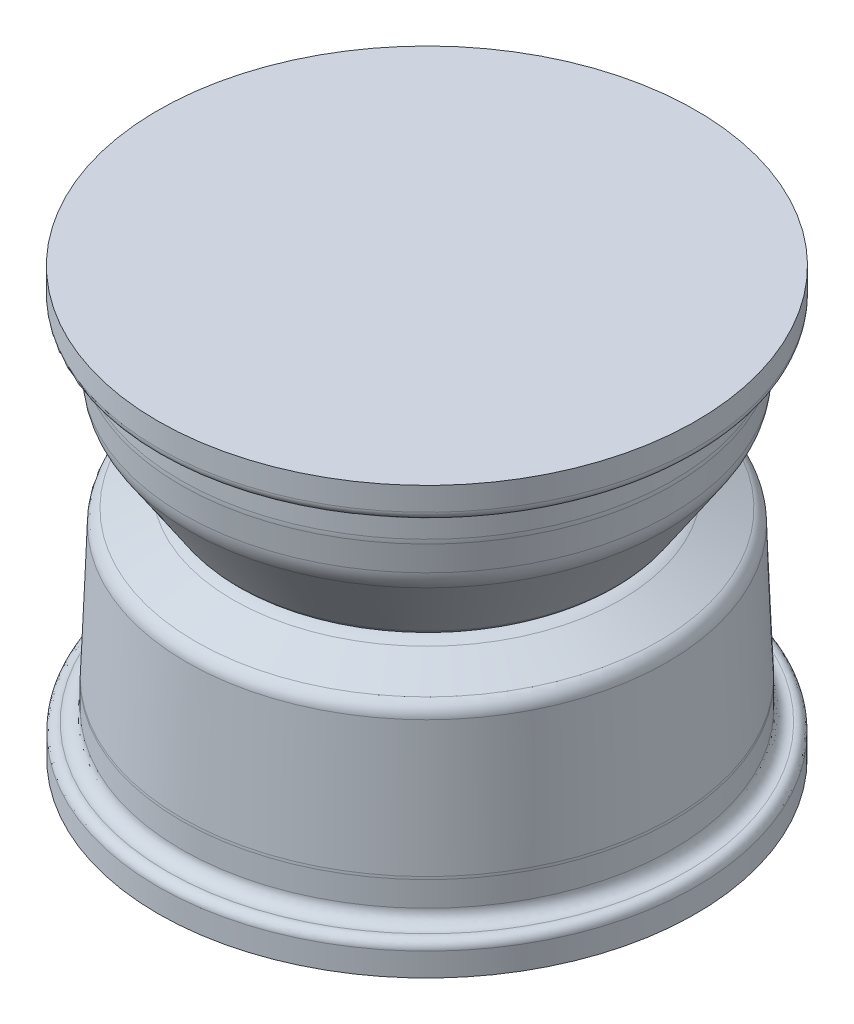
ISO-10303-21;
HEADER;
FILE_DESCRIPTION(('STEP AP214'),'2;1');
FILE_NAME('part.step','',(''),(''),'','','');
FILE_SCHEMA(('AUTOMOTIVE_DESIGN { 1 0 10303 214 1 1 1 1 }'));
ENDSEC;
DATA;
#1=APPLICATION_CONTEXT('core data for automotive mechanical design processes');
#2=APPLICATION_PROTOCOL_DEFINITION('international standard','automotive_design',2000,#1);
#3=PRODUCT_CONTEXT('',#1,'mechanical');
#4=PRODUCT('Part','Part','',(#3));
#5=PRODUCT_RELATED_PRODUCT_CATEGORY('part','',(#4));
#6=PRODUCT_DEFINITION_FORMATION('','',#4);
#7=PRODUCT_DEFINITION_CONTEXT('part definition',#1,'design');
#8=PRODUCT_DEFINITION('design','',#6,#7);
#9=PRODUCT_DEFINITION_SHAPE('','',#8);
#10=(LENGTH_UNIT() NAMED_UNIT(*) SI_UNIT(.MILLI.,.METRE.));
#11=(NAMED_UNIT(*) PLANE_ANGLE_UNIT() SI_UNIT($,.RADIAN.));
#12=(NAMED_UNIT(*) SI_UNIT($,.STERADIAN.) SOLID_ANGLE_UNIT());
#13=UNCERTAINTY_MEASURE_WITH_UNIT(LENGTH_MEASURE(1.E-05),#10,'distance_accuracy_value','');
#14=(GEOMETRIC_REPRESENTATION_CONTEXT(3) GLOBAL_UNCERTAINTY_ASSIGNED_CONTEXT((#13)) GLOBAL_UNIT_ASSIGNED_CONTEXT((#10,
#11,#12)) REPRESENTATION_CONTEXT('',''));
#15=CARTESIAN_POINT('',(0.,0.,0.));
#16=DIRECTION('',(0.,0.,1.));
#17=DIRECTION('',(1.,0.,0.));
#18=AXIS2_PLACEMENT_3D('',#15,#16,#17);
#19=CARTESIAN_POINT('',(0.,13.0472913738795,91.7987750000028));
#20=DIRECTION('',(0.,-1.,0.));
#21=DIRECTION('',(0.,0.,-1.));
#22=AXIS2_PLACEMENT_3D('',#19,#20,#21);
#23=PLANE('',#22);
#24=CARTESIAN_POINT('',(0.,13.0472913738795,0.));
#25=DIRECTION('',(0.,1.,0.));
#26=DIRECTION('',(0.,0.,1.));
#27=AXIS2_PLACEMENT_3D('',#24,#25,#26);
#28=CIRCLE('',#27,91.1860000000005);
#29=CARTESIAN_POINT('',(0.,13.0472913738795,91.1860000000005));
#30=VERTEX_POINT('',#29);
#31=EDGE_CURVE('E96',#30,#30,#28,.T.);
#32=ORIENTED_EDGE('',*,*,#31,.F.);
#33=EDGE_LOOP('',(#32));
#34=FACE_BOUND('',#33,.T.);
#35=CARTESIAN_POINT('',(0.,13.0472913738795,0.));
#36=DIRECTION('',(0.,1.,0.));
#37=DIRECTION('',(0.,0.,1.));
#38=AXIS2_PLACEMENT_3D('',#35,#36,#37);
#39=CIRCLE('',#38,91.7987750000028);
#40=CARTESIAN_POINT('',(0.,13.0472913738795,91.7987750000028));
#41=VERTEX_POINT('',#40);
#42=EDGE_CURVE('E10',#41,#41,#39,.T.);
#43=ORIENTED_EDGE('',*,*,#42,.T.);
#44=EDGE_LOOP('',(#43));
#45=FACE_BOUND('',#44,.T.);
#46=ADVANCED_FACE('F32',(#34,#45),#23,.F.);
#47=CARTESIAN_POINT('',(0.,13.0472913738795,91.7987750000028));
#48=CARTESIAN_POINT('',(0.,13.0472913738793,94.605850648923));
#49=CARTESIAN_POINT('',(0.,12.4331662406384,97.3224330848818));
#50=CARTESIAN_POINT('',(0.,11.2624547169263,99.8255002525088));
#51=(BOUNDED_CURVE() B_SPLINE_CURVE(3,(#47,#48,#49,#50),.UNSPECIFIED.,.F.,
.F.) B_SPLINE_CURVE_WITH_KNOTS((4,4),(0.,1.),
.UNSPECIFIED.) CURVE() GEOMETRIC_REPRESENTATION_ITEM() RATIONAL_B_SPLINE_CURVE((0.254333095030252,
0.254333095030252,0.258499793724843,0.266833191114025)) REPRESENTATION_ITEM(''));
#52=CARTESIAN_POINT('',(0.,55.,0.));
#53=DIRECTION('',(0.,1.,0.));
#54=AXIS1_PLACEMENT('',#52,#53);
#55=SURFACE_OF_REVOLUTION('',#51,#54);
#56=CARTESIAN_POINT('',(0.,11.2624547169263,0.));
#57=DIRECTION('',(0.,1.,0.));
#58=DIRECTION('',(0.,0.,1.));
#59=AXIS2_PLACEMENT_3D('',#56,#57,#58);
#60=CIRCLE('',#59,99.8255002525088);
#61=CARTESIAN_POINT('',(0.,11.2624547169263,99.8255002525088));
#62=VERTEX_POINT('',#61);
#63=EDGE_CURVE('E38',#62,#62,#60,.T.);
#64=ORIENTED_EDGE('',*,*,#63,.T.);
#65=EDGE_LOOP('',(#64));
#66=FACE_BOUND('',#65,.T.);
#67=ORIENTED_EDGE('',*,*,#42,.F.);
#68=EDGE_LOOP('',(#67));
#69=FACE_BOUND('',#68,.T.);
#70=ADVANCED_FACE('F110',(#66,#69),#55,.F.);
#71=CARTESIAN_POINT('',(0.,2.26769556187344,0.));
#72=DIRECTION('',(0.,-1.,0.));
#73=DIRECTION('',(0.,0.,-1.));
#74=AXIS2_PLACEMENT_3D('',#71,#72,#73);
#75=CONICAL_SURFACE('',#74,119.056955539065,1.13331210913777);
#76=ORIENTED_EDGE('',*,*,#63,.F.);
#77=EDGE_LOOP('',(#76));
#78=FACE_BOUND('',#77,.T.);
#79=CARTESIAN_POINT('',(0.,2.26769556187344,0.));
#80=DIRECTION('',(0.,1.,0.));
#81=DIRECTION('',(0.,0.,1.));
#82=AXIS2_PLACEMENT_3D('',#79,#80,#81);
#83=CIRCLE('',#82,119.056955539065);
#84=CARTESIAN_POINT('',(0.,2.26769556187344,119.056955539065));
#85=VERTEX_POINT('',#84);
#86=EDGE_CURVE('E42',#85,#85,#83,.T.);
#87=ORIENTED_EDGE('',*,*,#86,.T.);
#88=EDGE_LOOP('',(#87));
#89=FACE_BOUND('',#88,.T.);
#90=ADVANCED_FACE('F113',(#78,#89),#75,.T.);
#91=CARTESIAN_POINT('',(0.,-4.97886739746323,0.));
#92=DIRECTION('',(0.,1.,0.));
#93=DIRECTION('',(0.,0.,1.));
#94=AXIS2_PLACEMENT_3D('',#91,#92,#93);
#95=TOROIDAL_SURFACE('',#94,115.667659848753,8.);
#96=ORIENTED_EDGE('',*,*,#86,.F.);
#97=EDGE_LOOP('',(#96));
#98=FACE_BOUND('',#97,.T.);
#99=CARTESIAN_POINT('',(0.,-4.67176492476311,0.));
#100=DIRECTION('',(0.,1.,0.));
#101=DIRECTION('',(0.,0.,1.));
#102=AXIS2_PLACEMENT_3D('',#99,#100,#101);
#103=CIRCLE('',#102,123.661763180038);
#104=CARTESIAN_POINT('',(0.,-4.67176492476311,123.661763180038));
#105=VERTEX_POINT('',#104);
#106=EDGE_CURVE('E46',#105,#105,#103,.T.);
#107=ORIENTED_EDGE('',*,*,#106,.T.);
#108=EDGE_LOOP('',(#107));
#109=FACE_BOUND('',#108,.T.);
#110=ADVANCED_FACE('F116',(#98,#109),#95,.T.);
#111=CARTESIAN_POINT('',(0.,-72.7393119640824,0.));
#112=DIRECTION('',(0.,-1.,0.));
#113=DIRECTION('',(0.,0.,-1.));
#114=AXIS2_PLACEMENT_3D('',#111,#112,#113);
#115=CONICAL_SURFACE('',#114,126.276654574374,0.0383972435438753);
#116=ORIENTED_EDGE('',*,*,#106,.F.);
#117=EDGE_LOOP('',(#116));
#118=FACE_BOUND('',#117,.T.);
#119=CARTESIAN_POINT('',(0.,-72.7393119640824,0.));
#120=DIRECTION('',(0.,1.,0.));
#121=DIRECTION('',(0.,0.,1.));
#122=AXIS2_PLACEMENT_3D('',#119,#120,#121);
#123=CIRCLE('',#122,126.276654574374);
#124=CARTESIAN_POINT('',(0.,-72.7393119640824,126.276654574374));
#125=VERTEX_POINT('',#124);
#126=EDGE_CURVE('E51',#125,#125,#123,.T.);
#127=ORIENTED_EDGE('',*,*,#126,.T.);
#128=EDGE_LOOP('',(#127));
#129=FACE_BOUND('',#128,.T.);
#130=ADVANCED_FACE('F120',(#118,#129),#115,.T.);
#131=CARTESIAN_POINT('',(0.,-74.0828852821458,0.));
#132=DIRECTION('',(0.,1.,0.));
#133=DIRECTION('',(0.,0.,1.));
#134=AXIS2_PLACEMENT_3D('',#131,#132,#133);
#135=TOROIDAL_SURFACE('',#134,91.302452500002,35.);
#136=ORIENTED_EDGE('',*,*,#126,.F.);
#137=EDGE_LOOP('',(#136));
#138=FACE_BOUND('',#137,.T.);
#139=CARTESIAN_POINT('',(0.,-74.0828852821459,0.));
#140=DIRECTION('',(0.,1.,0.));
#141=DIRECTION('',(0.,0.,1.));
#142=AXIS2_PLACEMENT_3D('',#139,#140,#141);
#143=CIRCLE('',#142,126.302452500002);
#144=CARTESIAN_POINT('',(0.,-74.0828852821459,126.302452500002));
#145=VERTEX_POINT('',#144);
#146=EDGE_CURVE('E54',#145,#145,#143,.T.);
#147=ORIENTED_EDGE('',*,*,#146,.T.);
#148=EDGE_LOOP('',(#147));
#149=FACE_BOUND('',#148,.T.);
#150=ADVANCED_FACE('F124',(#138,#149),#135,.T.);
#151=CARTESIAN_POINT('',(0.,55.,0.));
#152=DIRECTION('',(0.,1.,0.));
#153=DIRECTION('',(0.,0.,1.));
#154=AXIS2_PLACEMENT_3D('',#151,#152,#153);
#155=CYLINDRICAL_SURFACE('',#154,126.302452500002);
#156=CARTESIAN_POINT('',(0.,-86.8372465785219,0.));
#157=DIRECTION('',(0.,1.,0.));
#158=DIRECTION('',(0.,0.,1.));
#159=AXIS2_PLACEMENT_3D('',#156,#157,#158);
#160=CIRCLE('',#159,126.302452500002);
#161=CARTESIAN_POINT('',(0.,-86.8372465785219,126.302452500002));
#162=VERTEX_POINT('',#161);
#163=EDGE_CURVE('E57',#162,#162,#160,.T.);
#164=ORIENTED_EDGE('',*,*,#163,.T.);
#165=EDGE_LOOP('',(#164));
#166=FACE_BOUND('',#165,.T.);
#167=ORIENTED_EDGE('',*,*,#146,.F.);
#168=EDGE_LOOP('',(#167));
#169=FACE_BOUND('',#168,.T.);
#170=ADVANCED_FACE('F128',(#166,#169),#155,.T.);
#171=CARTESIAN_POINT('',(0.,-93.1247086261212,133.519735500002));
#172=CARTESIAN_POINT('',(0.,-93.7891310907864,128.834697888006));
#173=CARTESIAN_POINT('',(0.,-90.3594848036121,126.302452500002));
#174=CARTESIAN_POINT('',(0.,-86.8372465785219,126.302452500002));
#175=(BOUNDED_CURVE() B_SPLINE_CURVE(3,(#171,#172,#173,#174),.UNSPECIFIED.,.F.,
.F.) B_SPLINE_CURVE_WITH_KNOTS((4,4),(0.,1.),
.UNSPECIFIED.) CURVE() GEOMETRIC_REPRESENTATION_ITEM() RATIONAL_B_SPLINE_CURVE((0.255591691964593,
0.242825015050018,0.327183181081988,0.508666190060503)) REPRESENTATION_ITEM(''));
#176=CARTESIAN_POINT('',(0.,55.,0.));
#177=DIRECTION('',(0.,1.,0.));
#178=AXIS1_PLACEMENT('',#176,#177);
#179=SURFACE_OF_REVOLUTION('',#175,#178);
#180=ORIENTED_EDGE('',*,*,#163,.F.);
#181=EDGE_LOOP('',(#180));
#182=FACE_BOUND('',#181,.T.);
#183=CARTESIAN_POINT('',(0.,-93.1247086261212,0.));
#184=DIRECTION('',(0.,1.,0.));
#185=DIRECTION('',(0.,0.,1.));
#186=AXIS2_PLACEMENT_3D('',#183,#184,#185);
#187=CIRCLE('',#186,133.519735500002);
#188=CARTESIAN_POINT('',(0.,-93.1247086261212,133.519735500002));
#189=VERTEX_POINT('',#188);
#190=EDGE_CURVE('E60',#189,#189,#187,.T.);
#191=ORIENTED_EDGE('',*,*,#190,.T.);
#192=EDGE_LOOP('',(#191));
#193=FACE_BOUND('',#192,.T.);
#194=ADVANCED_FACE('F132',(#182,#193),#179,.T.);
#195=CARTESIAN_POINT('',(0.,-93.1247086261212,133.519735500002));
#196=CARTESIAN_POINT('',(0.,-92.6729013501488,136.705561076159));
#197=CARTESIAN_POINT('',(0.,-95.0050608254273,138.427487940002));
#198=CARTESIAN_POINT('',(0.,-97.4001828184885,138.427487940002));
#199=(BOUNDED_CURVE() B_SPLINE_CURVE(3,(#195,#196,#197,#198),.UNSPECIFIED.,.F.,
.F.) B_SPLINE_CURVE_WITH_KNOTS((4,4),(0.,1.),
.UNSPECIFIED.) CURVE() GEOMETRIC_REPRESENTATION_ITEM() RATIONAL_B_SPLINE_CURVE((0.255591691964592,
0.242825015050017,0.327183181081988,0.508666190060503)) REPRESENTATION_ITEM(''));
#200=CARTESIAN_POINT('',(0.,55.,0.));
#201=DIRECTION('',(0.,1.,0.));
#202=AXIS1_PLACEMENT('',#200,#201);
#203=SURFACE_OF_REVOLUTION('',#199,#202);
#204=CARTESIAN_POINT('',(0.,-97.4001828184885,0.));
#205=DIRECTION('',(0.,1.,0.));
#206=DIRECTION('',(0.,0.,1.));
#207=AXIS2_PLACEMENT_3D('',#204,#205,#206);
#208=CIRCLE('',#207,138.427487940002);
#209=CARTESIAN_POINT('',(0.,-97.4001828184885,138.427487940002));
#210=VERTEX_POINT('',#209);
#211=EDGE_CURVE('E63',#210,#210,#208,.T.);
#212=ORIENTED_EDGE('',*,*,#211,.T.);
#213=EDGE_LOOP('',(#212));
#214=FACE_BOUND('',#213,.T.);
#215=ORIENTED_EDGE('',*,*,#190,.F.);
#216=EDGE_LOOP('',(#215));
#217=FACE_BOUND('',#216,.T.);
#218=ADVANCED_FACE('F136',(#214,#217),#203,.F.);
#219=CARTESIAN_POINT('',(0.,55.,0.));
#220=DIRECTION('',(0.,1.,0.));
#221=DIRECTION('',(0.,0.,1.));
#222=AXIS2_PLACEMENT_3D('',#219,#220,#221);
#223=CYLINDRICAL_SURFACE('',#222,138.427487940002);
#224=CARTESIAN_POINT('',(0.,-109.400182818489,0.));
#225=DIRECTION('',(0.,1.,0.));
#226=DIRECTION('',(0.,0.,1.));
#227=AXIS2_PLACEMENT_3D('',#224,#225,#226);
#228=CIRCLE('',#227,138.427487940002);
#229=CARTESIAN_POINT('',(0.,-109.400182818489,138.427487940002));
#230=VERTEX_POINT('',#229);
#231=EDGE_CURVE('E66',#230,#230,#228,.T.);
#232=ORIENTED_EDGE('',*,*,#231,.T.);
#233=EDGE_LOOP('',(#232));
#234=FACE_BOUND('',#233,.T.);
#235=ORIENTED_EDGE('',*,*,#211,.F.);
#236=EDGE_LOOP('',(#235));
#237=FACE_BOUND('',#236,.T.);
#238=ADVANCED_FACE('F140',(#234,#237),#223,.T.);
#239=CARTESIAN_POINT('',(0.,-109.400182818489,138.427487940002));
#240=DIRECTION('',(0.,-1.,0.));
#241=DIRECTION('',(0.,0.,-1.));
#242=AXIS2_PLACEMENT_3D('',#239,#240,#241);
#243=PLANE('',#242);
#244=ORIENTED_EDGE('',*,*,#231,.F.);
#245=EDGE_LOOP('',(#244));
#246=FACE_BOUND('',#245,.T.);
#247=ADVANCED_FACE('F150',(#246),#243,.T.);
#248=CARTESIAN_POINT('',(0.,110.365316058993,138.555289406168));
#249=DIRECTION('',(0.,-1.,0.));
#250=DIRECTION('',(0.,0.,-1.));
#251=AXIS2_PLACEMENT_3D('',#248,#249,#250);
#252=PLANE('',#251);
#253=CARTESIAN_POINT('',(0.,110.365316058993,0.));
#254=DIRECTION('',(0.,1.,0.));
#255=DIRECTION('',(0.,0.,1.));
#256=AXIS2_PLACEMENT_3D('',#253,#254,#255);
#257=CIRCLE('',#256,138.555289406168);
#258=CARTESIAN_POINT('',(0.,110.365316058993,138.555289406168));
#259=VERTEX_POINT('',#258);
#260=EDGE_CURVE('E69',#259,#259,#257,.T.);
#261=ORIENTED_EDGE('',*,*,#260,.T.);
#262=EDGE_LOOP('',(#261));
#263=FACE_BOUND('',#262,.T.);
#264=ADVANCED_FACE('F154',(#263),#252,.F.);
#265=CARTESIAN_POINT('',(0.,55.,0.));
#266=DIRECTION('',(0.,1.,0.));
#267=DIRECTION('',(0.,0.,1.));
#268=AXIS2_PLACEMENT_3D('',#265,#266,#267);
#269=CYLINDRICAL_SURFACE('',#268,138.555289406168);
#270=ORIENTED_EDGE('',*,*,#260,.F.);
#271=EDGE_LOOP('',(#270));
#272=FACE_BOUND('',#271,.T.);
#273=CARTESIAN_POINT('',(0.,98.3653160589928,0.));
#274=DIRECTION('',(0.,1.,0.));
#275=DIRECTION('',(0.,0.,1.));
#276=AXIS2_PLACEMENT_3D('',#273,#274,#275);
#277=CIRCLE('',#276,138.555289406168);
#278=CARTESIAN_POINT('',(0.,98.3653160589928,138.555289406168));
#279=VERTEX_POINT('',#278);
#280=EDGE_CURVE('E72',#279,#279,#277,.T.);
#281=ORIENTED_EDGE('',*,*,#280,.T.);
#282=EDGE_LOOP('',(#281));
#283=FACE_BOUND('',#282,.T.);
#284=ADVANCED_FACE('F158',(#272,#283),#269,.T.);
#285=CARTESIAN_POINT('',(0.,98.2420105318187,0.));
#286=DIRECTION('',(0.,1.,0.));
#287=DIRECTION('',(0.,0.,1.));
#288=AXIS2_PLACEMENT_3D('',#285,#286,#287);
#289=TOROIDAL_SURFACE('',#288,134.112,4.44499999999991);
#290=CARTESIAN_POINT('',(0.,93.8192913738797,0.));
#291=DIRECTION('',(0.,1.,0.));
#292=DIRECTION('',(0.,0.,1.));
#293=AXIS2_PLACEMENT_3D('',#290,#291,#292);
#294=CIRCLE('',#293,133.667500000001);
#295=CARTESIAN_POINT('',(0.,93.8192913738797,133.667500000001));
#296=VERTEX_POINT('',#295);
#297=EDGE_CURVE('E75',#296,#296,#294,.T.);
#298=ORIENTED_EDGE('',*,*,#297,.T.);
#299=EDGE_LOOP('',(#298));
#300=FACE_BOUND('',#299,.T.);
#301=ORIENTED_EDGE('',*,*,#280,.F.);
#302=EDGE_LOOP('',(#301));
#303=FACE_BOUND('',#302,.T.);
#304=ADVANCED_FACE('F162',(#300,#303),#289,.T.);
#305=CARTESIAN_POINT('',(0.,87.5011211482528,0.));
#306=DIRECTION('',(0.,1.,0.));
#307=DIRECTION('',(0.,0.,1.));
#308=AXIS2_PLACEMENT_3D('',#305,#306,#307);
#309=TOROIDAL_SURFACE('',#308,133.0325,6.34999999999996);
#310=ORIENTED_EDGE('',*,*,#297,.F.);
#311=EDGE_LOOP('',(#310));
#312=FACE_BOUND('',#311,.T.);
#313=CARTESIAN_POINT('',(0.,87.5011211482528,0.));
#314=DIRECTION('',(0.,1.,0.));
#315=DIRECTION('',(0.,0.,1.));
#316=AXIS2_PLACEMENT_3D('',#313,#314,#315);
#317=CIRCLE('',#316,126.6825);
#318=CARTESIAN_POINT('',(0.,87.5011211482528,126.6825));
#319=VERTEX_POINT('',#318);
#320=EDGE_CURVE('E78',#319,#319,#317,.T.);
#321=ORIENTED_EDGE('',*,*,#320,.T.);
#322=EDGE_LOOP('',(#321));
#323=FACE_BOUND('',#322,.T.);
#324=ADVANCED_FACE('F166',(#312,#323),#309,.F.);
#325=CARTESIAN_POINT('',(0.,55.,0.));
#326=DIRECTION('',(0.,1.,0.));
#327=DIRECTION('',(0.,0.,1.));
#328=AXIS2_PLACEMENT_3D('',#325,#326,#327);
#329=CYLINDRICAL_SURFACE('',#328,126.6825);
#330=CARTESIAN_POINT('',(0.,77.9442913738797,0.));
#331=DIRECTION('',(0.,1.,0.));
#332=DIRECTION('',(0.,0.,1.));
#333=AXIS2_PLACEMENT_3D('',#330,#331,#332);
#334=CIRCLE('',#333,126.6825);
#335=CARTESIAN_POINT('',(0.,77.9442913738797,126.6825));
#336=VERTEX_POINT('',#335);
#337=EDGE_CURVE('E81',#336,#336,#334,.T.);
#338=ORIENTED_EDGE('',*,*,#337,.T.);
#339=EDGE_LOOP('',(#338));
#340=FACE_BOUND('',#339,.T.);
#341=ORIENTED_EDGE('',*,*,#320,.F.);
#342=EDGE_LOOP('',(#341));
#343=FACE_BOUND('',#342,.T.);
#344=ADVANCED_FACE('F170',(#340,#343),#329,.T.);
#345=CARTESIAN_POINT('',(0.,77.9442913738795,0.));
#346=DIRECTION('',(0.,1.,0.));
#347=DIRECTION('',(0.,0.,1.));
#348=AXIS2_PLACEMENT_3D('',#345,#346,#347);
#349=TOROIDAL_SURFACE('',#348,101.2825,25.3999999999999);
#350=CARTESIAN_POINT('',(0.,75.7305355080894,0.));
#351=DIRECTION('',(0.,1.,0.));
#352=DIRECTION('',(0.,0.,1.));
#353=AXIS2_PLACEMENT_3D('',#350,#351,#352);
#354=CIRCLE('',#353,126.58584533153);
#355=CARTESIAN_POINT('',(0.,75.7305355080894,126.58584533153));
#356=VERTEX_POINT('',#355);
#357=EDGE_CURVE('E84',#356,#356,#354,.T.);
#358=ORIENTED_EDGE('',*,*,#357,.T.);
#359=EDGE_LOOP('',(#358));
#360=FACE_BOUND('',#359,.T.);
#361=ORIENTED_EDGE('',*,*,#337,.F.);
#362=EDGE_LOOP('',(#361));
#363=FACE_BOUND('',#362,.T.);
#364=ADVANCED_FACE('F174',(#360,#363),#349,.T.);
#365=CARTESIAN_POINT('',(0.,75.7305355080894,0.));
#366=DIRECTION('',(0.,1.,0.));
#367=DIRECTION('',(0.,0.,1.));
#368=AXIS2_PLACEMENT_3D('',#365,#366,#367);
#369=CONICAL_SURFACE('',#368,126.58584533153,0.0872664625997177);
#370=CARTESIAN_POINT('',(0.,62.0692913738798,0.));
#371=DIRECTION('',(0.,1.,0.));
#372=DIRECTION('',(0.,0.,1.));
#373=AXIS2_PLACEMENT_3D('',#370,#371,#372);
#374=CIRCLE('',#373,125.390641340127);
#375=CARTESIAN_POINT('',(0.,62.0692913738798,125.390641340127));
#376=VERTEX_POINT('',#375);
#377=EDGE_CURVE('E87',#376,#376,#374,.T.);
#378=ORIENTED_EDGE('',*,*,#377,.T.);
#379=EDGE_LOOP('',(#378));
#380=FACE_BOUND('',#379,.T.);
#381=ORIENTED_EDGE('',*,*,#357,.F.);
#382=EDGE_LOOP('',(#381));
#383=FACE_BOUND('',#382,.T.);
#384=ADVANCED_FACE('F178',(#380,#383),#369,.T.);
#385=CARTESIAN_POINT('',(0.,63.7296082732224,0.));
#386=DIRECTION('',(0.,1.,0.));
#387=DIRECTION('',(0.,0.,1.));
#388=AXIS2_PLACEMENT_3D('',#385,#386,#387);
#389=TOROIDAL_SURFACE('',#388,106.413132341479,19.05);
#390=CARTESIAN_POINT('',(0.,53.1367629291311,0.));
#391=DIRECTION('',(0.,1.,0.));
#392=DIRECTION('',(0.,0.,1.));
#393=AXIS2_PLACEMENT_3D('',#390,#391,#392);
#394=CIRCLE('',#393,122.246455666548);
#395=CARTESIAN_POINT('',(0.,53.1367629291311,122.246455666548));
#396=VERTEX_POINT('',#395);
#397=EDGE_CURVE('E90',#396,#396,#394,.T.);
#398=ORIENTED_EDGE('',*,*,#397,.T.);
#399=EDGE_LOOP('',(#398));
#400=FACE_BOUND('',#399,.T.);
#401=ORIENTED_EDGE('',*,*,#377,.F.);
#402=EDGE_LOOP('',(#401));
#403=FACE_BOUND('',#402,.T.);
#404=ADVANCED_FACE('F182',(#400,#403),#389,.T.);
#405=CARTESIAN_POINT('',(0.,53.1367629291311,0.));
#406=DIRECTION('',(0.,1.,0.));
#407=DIRECTION('',(0.,0.,1.));
#408=AXIS2_PLACEMENT_3D('',#405,#406,#407);
#409=CONICAL_SURFACE('',#408,122.246455666548,0.58963160852596);
#410=CARTESIAN_POINT('',(0.,16.5711058138414,0.));
#411=DIRECTION('',(0.,1.,0.));
#412=DIRECTION('',(0.,0.,1.));
#413=AXIS2_PLACEMENT_3D('',#410,#411,#412);
#414=CIRCLE('',#413,97.7832180521123);
#415=CARTESIAN_POINT('',(0.,16.5711058138414,97.7832180521123));
#416=VERTEX_POINT('',#415);
#417=EDGE_CURVE('E93',#416,#416,#414,.T.);
#418=ORIENTED_EDGE('',*,*,#417,.T.);
#419=EDGE_LOOP('',(#418));
#420=FACE_BOUND('',#419,.T.);
#421=ORIENTED_EDGE('',*,*,#397,.F.);
#422=EDGE_LOOP('',(#421));
#423=FACE_BOUND('',#422,.T.);
#424=ADVANCED_FACE('F186',(#420,#423),#409,.T.);
#425=CARTESIAN_POINT('',(0.,20.9847913738796,0.));
#426=DIRECTION('',(0.,1.,0.));
#427=DIRECTION('',(0.,0.,1.));
#428=AXIS2_PLACEMENT_3D('',#425,#426,#427);
#429=TOROIDAL_SURFACE('',#428,91.1860000000004,7.93750000000004);
#430=ORIENTED_EDGE('',*,*,#31,.T.);
#431=EDGE_LOOP('',(#430));
#432=FACE_BOUND('',#431,.T.);
#433=ORIENTED_EDGE('',*,*,#417,.F.);
#434=EDGE_LOOP('',(#433));
#435=FACE_BOUND('',#434,.T.);
#436=ADVANCED_FACE('F190',(#432,#435),#429,.T.);
#437=CLOSED_SHELL('',(#46,#70,#90,#110,#130,#150,#170,#194,#218,#238,#247,#264,#284,#304,#324,
#344,#364,#384,#404,#424,#436));
#438=MANIFOLD_SOLID_BREP('B2',#437);
#439=ADVANCED_BREP_SHAPE_REPRESENTATION('',(#18,#438),#14);
#440=SHAPE_DEFINITION_REPRESENTATION(#9,#439);
ENDSEC;
END-ISO-10303-21;
